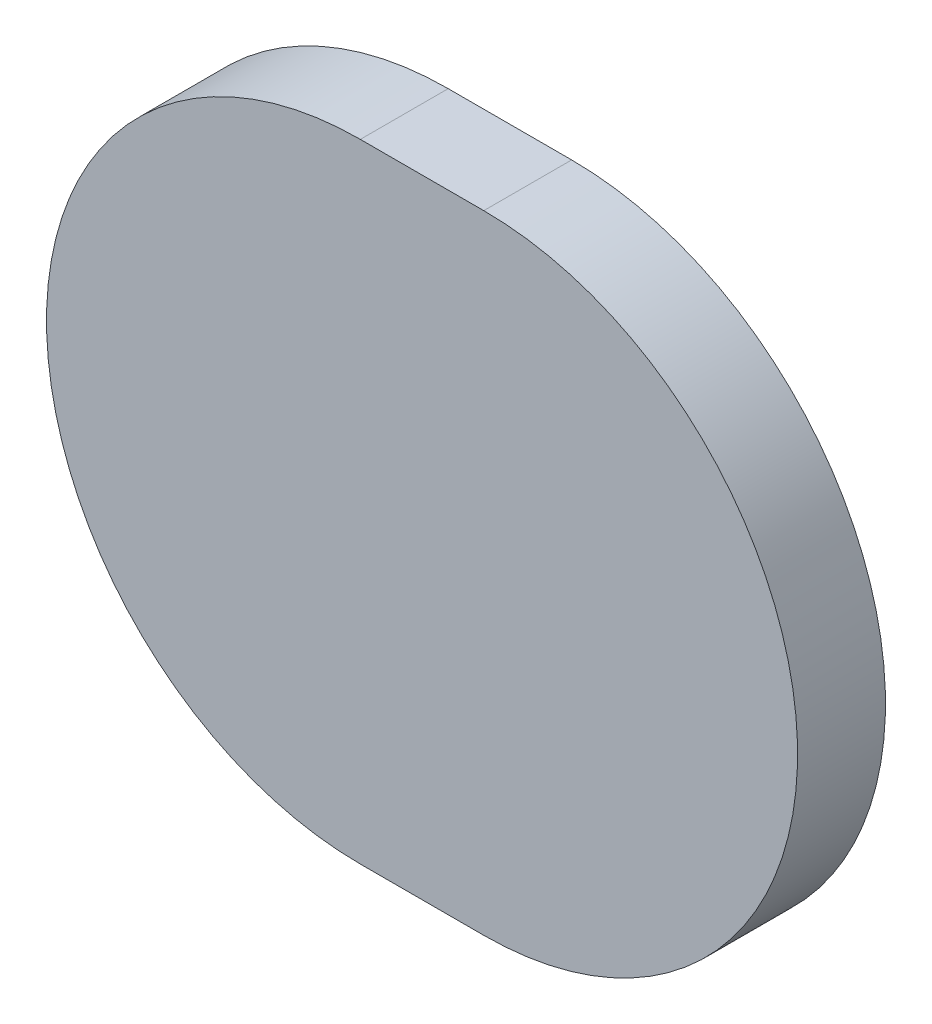
ISO-10303-21;
HEADER;
FILE_DESCRIPTION(('STEP AP214'),'2;1');
FILE_NAME('part.step','',(''),(''),'','','');
FILE_SCHEMA(('AUTOMOTIVE_DESIGN { 1 0 10303 214 1 1 1 1 }'));
ENDSEC;
DATA;
#1=APPLICATION_CONTEXT('core data for automotive mechanical design processes');
#2=APPLICATION_PROTOCOL_DEFINITION('international standard','automotive_design',2000,#1);
#3=PRODUCT_CONTEXT('',#1,'mechanical');
#4=PRODUCT('Part','Part','',(#3));
#5=PRODUCT_RELATED_PRODUCT_CATEGORY('part','',(#4));
#6=PRODUCT_DEFINITION_FORMATION('','',#4);
#7=PRODUCT_DEFINITION_CONTEXT('part definition',#1,'design');
#8=PRODUCT_DEFINITION('design','',#6,#7);
#9=PRODUCT_DEFINITION_SHAPE('','',#8);
#10=(LENGTH_UNIT() NAMED_UNIT(*) SI_UNIT(.MILLI.,.METRE.));
#11=(NAMED_UNIT(*) PLANE_ANGLE_UNIT() SI_UNIT($,.RADIAN.));
#12=(NAMED_UNIT(*) SI_UNIT($,.STERADIAN.) SOLID_ANGLE_UNIT());
#13=UNCERTAINTY_MEASURE_WITH_UNIT(LENGTH_MEASURE(1.E-05),#10,'distance_accuracy_value','');
#14=(GEOMETRIC_REPRESENTATION_CONTEXT(3) GLOBAL_UNCERTAINTY_ASSIGNED_CONTEXT((#13)) GLOBAL_UNIT_ASSIGNED_CONTEXT((#10,
#11,#12)) REPRESENTATION_CONTEXT('',''));
#15=CARTESIAN_POINT('',(0.,0.,0.));
#16=DIRECTION('',(0.,0.,1.));
#17=DIRECTION('',(1.,0.,0.));
#18=AXIS2_PLACEMENT_3D('',#15,#16,#17);
#19=CARTESIAN_POINT('',(99.3170226,84.0599284,0.));
#20=DIRECTION('',(0.,1.,0.));
#21=DIRECTION('',(1.,0.,0.));
#22=AXIS2_PLACEMENT_3D('',#19,#20,#21);
#23=PLANE('',#22);
#24=DIRECTION('',(1.,0.,0.));
#25=VECTOR('',#24,1.);
#26=CARTESIAN_POINT('',(99.3170226,84.0599284,0.03556));
#27=LINE('',#26,#25);
#28=CARTESIAN_POINT('',(99.3170226,84.0599284,0.03556));
#29=VERTEX_POINT('',#28);
#30=CARTESIAN_POINT('',(99.3669844,84.0599284,0.03556));
#31=VERTEX_POINT('',#30);
#32=EDGE_CURVE('E11',#29,#31,#27,.T.);
#33=ORIENTED_EDGE('',*,*,#32,.F.);
#34=DIRECTION('',(0.,0.,1.));
#35=VECTOR('',#34,1.);
#36=CARTESIAN_POINT('',(99.3170226,84.0599284,0.));
#37=LINE('',#36,#35);
#38=CARTESIAN_POINT('',(99.3170226,84.0599284,0.));
#39=VERTEX_POINT('',#38);
#40=EDGE_CURVE('E24',#39,#29,#37,.T.);
#41=ORIENTED_EDGE('',*,*,#40,.F.);
#42=DIRECTION('',(1.,0.,0.));
#43=VECTOR('',#42,1.);
#44=CARTESIAN_POINT('',(99.3170226,84.0599284,0.));
#45=LINE('',#44,#43);
#46=CARTESIAN_POINT('',(99.3669844,84.0599284,0.));
#47=VERTEX_POINT('',#46);
#48=EDGE_CURVE('E75',#39,#47,#45,.T.);
#49=ORIENTED_EDGE('',*,*,#48,.T.);
#50=DIRECTION('',(0.,0.,1.));
#51=VECTOR('',#50,1.);
#52=CARTESIAN_POINT('',(99.3669844,84.0599284,0.));
#53=LINE('',#52,#51);
#54=EDGE_CURVE('E37',#47,#31,#53,.T.);
#55=ORIENTED_EDGE('',*,*,#54,.T.);
#56=EDGE_LOOP('',(#33,#41,#49,#55));
#57=FACE_BOUND('',#56,.T.);
#58=ADVANCED_FACE('F17',(#57),#23,.F.);
#59=CARTESIAN_POINT('',(99.3669844,84.1869284,0.));
#60=DIRECTION('',(0.,0.,-1.));
#61=DIRECTION('',(1.11896493820492E-13,-1.,0.));
#62=AXIS2_PLACEMENT_3D('',#59,#60,#61);
#63=CYLINDRICAL_SURFACE('',#62,0.127);
#64=CARTESIAN_POINT('',(99.3669844,84.1869284,0.03556));
#65=DIRECTION('',(0.,0.,1.));
#66=DIRECTION('',(1.11896493820492E-13,-1.,0.));
#67=AXIS2_PLACEMENT_3D('',#64,#65,#66);
#68=CIRCLE('',#67,0.127);
#69=CARTESIAN_POINT('',(99.3669844,84.3139284,0.03556));
#70=VERTEX_POINT('',#69);
#71=EDGE_CURVE('E83',#31,#70,#68,.T.);
#72=ORIENTED_EDGE('',*,*,#71,.F.);
#73=ORIENTED_EDGE('',*,*,#54,.F.);
#74=CARTESIAN_POINT('',(99.3669844,84.1869284,0.));
#75=DIRECTION('',(0.,0.,1.));
#76=DIRECTION('',(1.11896493820492E-13,-1.,0.));
#77=AXIS2_PLACEMENT_3D('',#74,#75,#76);
#78=CIRCLE('',#77,0.127);
#79=CARTESIAN_POINT('',(99.3669844,84.3139284,0.));
#80=VERTEX_POINT('',#79);
#81=EDGE_CURVE('E81',#47,#80,#78,.T.);
#82=ORIENTED_EDGE('',*,*,#81,.T.);
#83=DIRECTION('',(0.,0.,1.));
#84=VECTOR('',#83,1.);
#85=CARTESIAN_POINT('',(99.3669844,84.3139284,0.));
#86=LINE('',#85,#84);
#87=EDGE_CURVE('E67',#80,#70,#86,.T.);
#88=ORIENTED_EDGE('',*,*,#87,.T.);
#89=EDGE_LOOP('',(#72,#73,#82,#88));
#90=FACE_BOUND('',#89,.T.);
#91=ADVANCED_FACE('F89',(#90),#63,.T.);
#92=CARTESIAN_POINT('',(99.3669844,84.3139284,0.));
#93=DIRECTION('',(0.,-1.,0.));
#94=DIRECTION('',(-1.,0.,0.));
#95=AXIS2_PLACEMENT_3D('',#92,#93,#94);
#96=PLANE('',#95);
#97=DIRECTION('',(-1.,0.,0.));
#98=VECTOR('',#97,1.);
#99=CARTESIAN_POINT('',(99.3669844,84.3139284,0.03556));
#100=LINE('',#99,#98);
#101=CARTESIAN_POINT('',(99.3170226,84.3139284,0.03556));
#102=VERTEX_POINT('',#101);
#103=EDGE_CURVE('E71',#70,#102,#100,.T.);
#104=ORIENTED_EDGE('',*,*,#103,.F.);
#105=ORIENTED_EDGE('',*,*,#87,.F.);
#106=DIRECTION('',(-1.,0.,0.));
#107=VECTOR('',#106,1.);
#108=CARTESIAN_POINT('',(99.3669844,84.3139284,0.));
#109=LINE('',#108,#107);
#110=CARTESIAN_POINT('',(99.3170226,84.3139284,0.));
#111=VERTEX_POINT('',#110);
#112=EDGE_CURVE('E63',#80,#111,#109,.T.);
#113=ORIENTED_EDGE('',*,*,#112,.T.);
#114=DIRECTION('',(0.,0.,1.));
#115=VECTOR('',#114,1.);
#116=CARTESIAN_POINT('',(99.3170226,84.3139284,0.));
#117=LINE('',#116,#115);
#118=EDGE_CURVE('E53',#111,#102,#117,.T.);
#119=ORIENTED_EDGE('',*,*,#118,.T.);
#120=EDGE_LOOP('',(#104,#105,#113,#119));
#121=FACE_BOUND('',#120,.T.);
#122=ADVANCED_FACE('F66',(#121),#96,.F.);
#123=CARTESIAN_POINT('',(99.3170226,84.1869284,0.));
#124=DIRECTION('',(0.,0.,-1.));
#125=DIRECTION('',(-1.11896493820492E-13,1.,0.));
#126=AXIS2_PLACEMENT_3D('',#123,#124,#125);
#127=CYLINDRICAL_SURFACE('',#126,0.127);
#128=CARTESIAN_POINT('',(99.3170226,84.1869284,0.03556));
#129=DIRECTION('',(0.,0.,1.));
#130=DIRECTION('',(-1.11896493820492E-13,1.,0.));
#131=AXIS2_PLACEMENT_3D('',#128,#129,#130);
#132=CIRCLE('',#131,0.127);
#133=EDGE_CURVE('E59',#102,#29,#132,.T.);
#134=ORIENTED_EDGE('',*,*,#133,.F.);
#135=ORIENTED_EDGE('',*,*,#118,.F.);
#136=CARTESIAN_POINT('',(99.3170226,84.1869284,0.));
#137=DIRECTION('',(0.,0.,1.));
#138=DIRECTION('',(-1.11896493820492E-13,1.,0.));
#139=AXIS2_PLACEMENT_3D('',#136,#137,#138);
#140=CIRCLE('',#139,0.127);
#141=EDGE_CURVE('E57',#111,#39,#140,.T.);
#142=ORIENTED_EDGE('',*,*,#141,.T.);
#143=ORIENTED_EDGE('',*,*,#40,.T.);
#144=EDGE_LOOP('',(#134,#135,#142,#143));
#145=FACE_BOUND('',#144,.T.);
#146=ADVANCED_FACE('F55',(#145),#127,.T.);
#147=CARTESIAN_POINT('',(99.3170226,84.0599284,0.));
#148=DIRECTION('',(0.,0.,-1.));
#149=DIRECTION('',(-1.,0.,0.));
#150=AXIS2_PLACEMENT_3D('',#147,#148,#149);
#151=PLANE('',#150);
#152=ORIENTED_EDGE('',*,*,#141,.F.);
#153=ORIENTED_EDGE('',*,*,#112,.F.);
#154=ORIENTED_EDGE('',*,*,#81,.F.);
#155=ORIENTED_EDGE('',*,*,#48,.F.);
#156=EDGE_LOOP('',(#152,#153,#154,#155));
#157=FACE_BOUND('',#156,.T.);
#158=ADVANCED_FACE('F74',(#157),#151,.T.);
#159=CARTESIAN_POINT('',(99.3170226,84.0599284,0.03556));
#160=DIRECTION('',(0.,0.,-1.));
#161=DIRECTION('',(-1.,0.,0.));
#162=AXIS2_PLACEMENT_3D('',#159,#160,#161);
#163=PLANE('',#162);
#164=ORIENTED_EDGE('',*,*,#32,.T.);
#165=ORIENTED_EDGE('',*,*,#71,.T.);
#166=ORIENTED_EDGE('',*,*,#103,.T.);
#167=ORIENTED_EDGE('',*,*,#133,.T.);
#168=EDGE_LOOP('',(#164,#165,#166,#167));
#169=FACE_BOUND('',#168,.T.);
#170=ADVANCED_FACE('F91',(#169),#163,.F.);
#171=CLOSED_SHELL('',(#58,#91,#122,#146,#158,#170));
#172=MANIFOLD_SOLID_BREP('B1',#171);
#173=ADVANCED_BREP_SHAPE_REPRESENTATION('',(#18,#172),#14);
#174=SHAPE_DEFINITION_REPRESENTATION(#9,#173);
ENDSEC;
END-ISO-10303-21;
